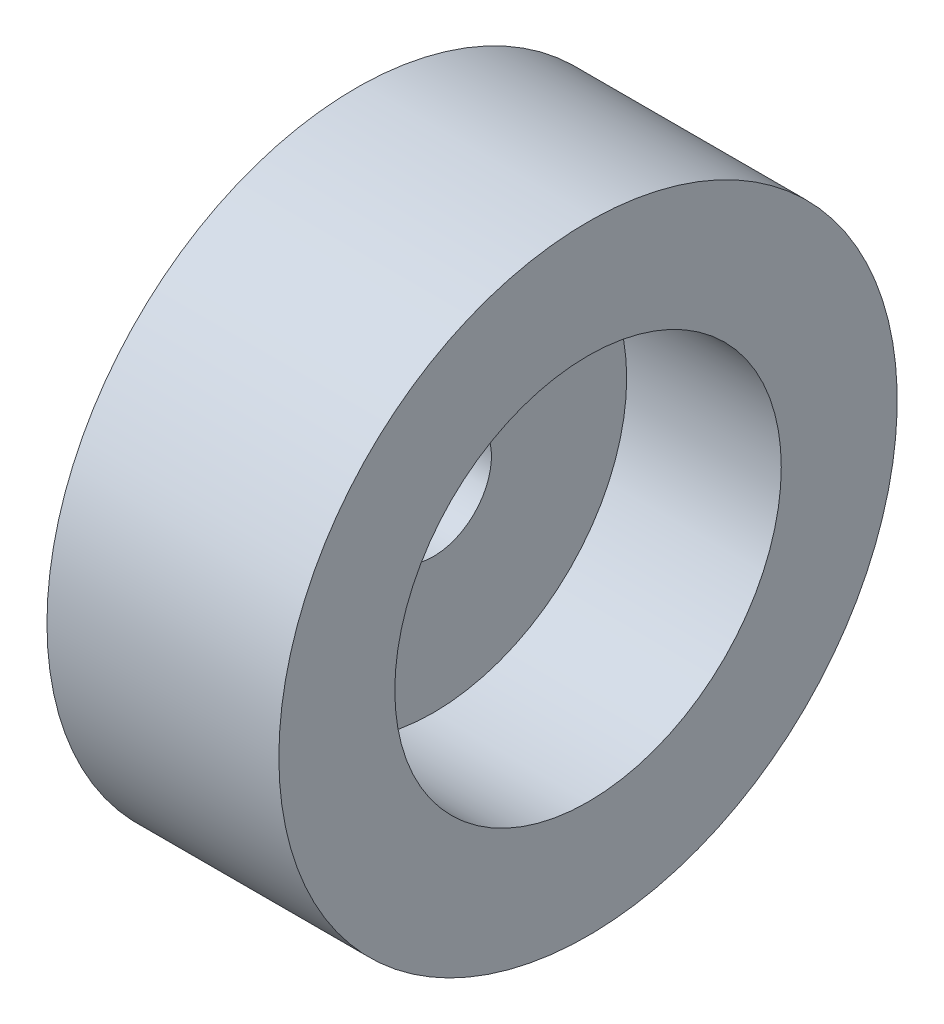
ISO-10303-21;
HEADER;
FILE_DESCRIPTION(('STEP AP214'),'2;1');
FILE_NAME('part.step','',(''),(''),'','','');
FILE_SCHEMA(('AUTOMOTIVE_DESIGN { 1 0 10303 214 1 1 1 1 }'));
ENDSEC;
DATA;
#1=APPLICATION_CONTEXT('core data for automotive mechanical design processes');
#2=APPLICATION_PROTOCOL_DEFINITION('international standard','automotive_design',2000,#1);
#3=PRODUCT_CONTEXT('',#1,'mechanical');
#4=PRODUCT('Part','Part','',(#3));
#5=PRODUCT_RELATED_PRODUCT_CATEGORY('part','',(#4));
#6=PRODUCT_DEFINITION_FORMATION('','',#4);
#7=PRODUCT_DEFINITION_CONTEXT('part definition',#1,'design');
#8=PRODUCT_DEFINITION('design','',#6,#7);
#9=PRODUCT_DEFINITION_SHAPE('','',#8);
#10=(LENGTH_UNIT() NAMED_UNIT(*) SI_UNIT(.MILLI.,.METRE.));
#11=(NAMED_UNIT(*) PLANE_ANGLE_UNIT() SI_UNIT($,.RADIAN.));
#12=(NAMED_UNIT(*) SI_UNIT($,.STERADIAN.) SOLID_ANGLE_UNIT());
#13=UNCERTAINTY_MEASURE_WITH_UNIT(LENGTH_MEASURE(1.E-05),#10,'distance_accuracy_value','');
#14=(GEOMETRIC_REPRESENTATION_CONTEXT(3) GLOBAL_UNCERTAINTY_ASSIGNED_CONTEXT((#13)) GLOBAL_UNIT_ASSIGNED_CONTEXT((#10,
#11,#12)) REPRESENTATION_CONTEXT('',''));
#15=CARTESIAN_POINT('',(0.,0.,0.));
#16=DIRECTION('',(0.,0.,1.));
#17=DIRECTION('',(1.,0.,0.));
#18=AXIS2_PLACEMENT_3D('',#15,#16,#17);
#19=CARTESIAN_POINT('',(0.,2.5,0.));
#20=DIRECTION('',(1.,0.,0.));
#21=DIRECTION('',(0.,0.,-1.));
#22=AXIS2_PLACEMENT_3D('',#19,#20,#21);
#23=PLANE('',#22);
#24=CARTESIAN_POINT('',(0.,0.,0.));
#25=DIRECTION('',(-1.,0.,0.));
#26=DIRECTION('',(0.,0.,1.));
#27=AXIS2_PLACEMENT_3D('',#24,#25,#26);
#28=CIRCLE('',#27,0.75);
#29=CARTESIAN_POINT('',(0.,0.,0.75));
#30=VERTEX_POINT('',#29);
#31=EDGE_CURVE('E10',#30,#30,#28,.T.);
#32=ORIENTED_EDGE('',*,*,#31,.F.);
#33=EDGE_LOOP('',(#32));
#34=FACE_BOUND('',#33,.T.);
#35=CARTESIAN_POINT('',(0.,0.,0.));
#36=DIRECTION('',(-1.,0.,0.));
#37=DIRECTION('',(0.,0.,1.));
#38=AXIS2_PLACEMENT_3D('',#35,#36,#37);
#39=CIRCLE('',#38,2.5);
#40=CARTESIAN_POINT('',(0.,0.,2.5));
#41=VERTEX_POINT('',#40);
#42=EDGE_CURVE('E72',#41,#41,#39,.T.);
#43=ORIENTED_EDGE('',*,*,#42,.T.);
#44=EDGE_LOOP('',(#43));
#45=FACE_BOUND('',#44,.T.);
#46=ADVANCED_FACE('F37',(#34,#45),#23,.F.);
#47=CARTESIAN_POINT('',(0.,0.,0.));
#48=DIRECTION('',(-1.,0.,0.));
#49=DIRECTION('',(0.,0.,1.));
#50=AXIS2_PLACEMENT_3D('',#47,#48,#49);
#51=CYLINDRICAL_SURFACE('',#50,0.75);
#52=CARTESIAN_POINT('',(2.,0.,0.));
#53=DIRECTION('',(-1.,0.,0.));
#54=DIRECTION('',(0.,0.,1.));
#55=AXIS2_PLACEMENT_3D('',#52,#53,#54);
#56=CIRCLE('',#55,0.75);
#57=CARTESIAN_POINT('',(2.,0.,0.75));
#58=VERTEX_POINT('',#57);
#59=EDGE_CURVE('E44',#58,#58,#56,.T.);
#60=ORIENTED_EDGE('',*,*,#59,.F.);
#61=EDGE_LOOP('',(#60));
#62=FACE_BOUND('',#61,.T.);
#63=ORIENTED_EDGE('',*,*,#31,.T.);
#64=EDGE_LOOP('',(#63));
#65=FACE_BOUND('',#64,.T.);
#66=ADVANCED_FACE('F110',(#62,#65),#51,.F.);
#67=CARTESIAN_POINT('',(2.,0.75,0.));
#68=DIRECTION('',(-1.,0.,0.));
#69=DIRECTION('',(0.,0.,1.));
#70=AXIS2_PLACEMENT_3D('',#67,#68,#69);
#71=PLANE('',#70);
#72=CARTESIAN_POINT('',(2.,0.,0.));
#73=DIRECTION('',(-1.,0.,0.));
#74=DIRECTION('',(0.,0.,1.));
#75=AXIS2_PLACEMENT_3D('',#72,#73,#74);
#76=CIRCLE('',#75,2.5);
#77=CARTESIAN_POINT('',(2.,0.,2.5));
#78=VERTEX_POINT('',#77);
#79=EDGE_CURVE('E49',#78,#78,#76,.T.);
#80=ORIENTED_EDGE('',*,*,#79,.F.);
#81=EDGE_LOOP('',(#80));
#82=FACE_BOUND('',#81,.T.);
#83=ORIENTED_EDGE('',*,*,#59,.T.);
#84=EDGE_LOOP('',(#83));
#85=FACE_BOUND('',#84,.T.);
#86=ADVANCED_FACE('F105',(#82,#85),#71,.F.);
#87=CARTESIAN_POINT('',(0.,0.,0.));
#88=DIRECTION('',(-1.,0.,0.));
#89=DIRECTION('',(0.,0.,1.));
#90=AXIS2_PLACEMENT_3D('',#87,#88,#89);
#91=CYLINDRICAL_SURFACE('',#90,2.5);
#92=CARTESIAN_POINT('',(4.,0.,0.));
#93=DIRECTION('',(-1.,0.,0.));
#94=DIRECTION('',(0.,0.,1.));
#95=AXIS2_PLACEMENT_3D('',#92,#93,#94);
#96=CIRCLE('',#95,2.5);
#97=CARTESIAN_POINT('',(4.,0.,2.5));
#98=VERTEX_POINT('',#97);
#99=EDGE_CURVE('E54',#98,#98,#96,.T.);
#100=ORIENTED_EDGE('',*,*,#99,.F.);
#101=EDGE_LOOP('',(#100));
#102=FACE_BOUND('',#101,.T.);
#103=ORIENTED_EDGE('',*,*,#79,.T.);
#104=EDGE_LOOP('',(#103));
#105=FACE_BOUND('',#104,.T.);
#106=ADVANCED_FACE('F99',(#102,#105),#91,.F.);
#107=CARTESIAN_POINT('',(4.,2.5,0.));
#108=DIRECTION('',(-1.,0.,0.));
#109=DIRECTION('',(0.,0.,1.));
#110=AXIS2_PLACEMENT_3D('',#107,#108,#109);
#111=PLANE('',#110);
#112=CARTESIAN_POINT('',(4.,0.,0.));
#113=DIRECTION('',(-1.,0.,0.));
#114=DIRECTION('',(0.,0.,1.));
#115=AXIS2_PLACEMENT_3D('',#112,#113,#114);
#116=CIRCLE('',#115,4.);
#117=CARTESIAN_POINT('',(4.,0.,4.));
#118=VERTEX_POINT('',#117);
#119=EDGE_CURVE('E60',#118,#118,#116,.T.);
#120=ORIENTED_EDGE('',*,*,#119,.F.);
#121=EDGE_LOOP('',(#120));
#122=FACE_BOUND('',#121,.T.);
#123=ORIENTED_EDGE('',*,*,#99,.T.);
#124=EDGE_LOOP('',(#123));
#125=FACE_BOUND('',#124,.T.);
#126=ADVANCED_FACE('F93',(#122,#125),#111,.F.);
#127=CARTESIAN_POINT('',(0.,0.,0.));
#128=DIRECTION('',(-1.,0.,0.));
#129=DIRECTION('',(0.,0.,1.));
#130=AXIS2_PLACEMENT_3D('',#127,#128,#129);
#131=CYLINDRICAL_SURFACE('',#130,4.);
#132=CARTESIAN_POINT('',(1.,0.,0.));
#133=DIRECTION('',(-1.,0.,0.));
#134=DIRECTION('',(0.,0.,1.));
#135=AXIS2_PLACEMENT_3D('',#132,#133,#134);
#136=CIRCLE('',#135,4.);
#137=CARTESIAN_POINT('',(1.,0.,4.));
#138=VERTEX_POINT('',#137);
#139=EDGE_CURVE('E64',#138,#138,#136,.T.);
#140=ORIENTED_EDGE('',*,*,#139,.F.);
#141=EDGE_LOOP('',(#140));
#142=FACE_BOUND('',#141,.T.);
#143=ORIENTED_EDGE('',*,*,#119,.T.);
#144=EDGE_LOOP('',(#143));
#145=FACE_BOUND('',#144,.T.);
#146=ADVANCED_FACE('F87',(#142,#145),#131,.T.);
#147=CARTESIAN_POINT('',(1.,4.,0.));
#148=DIRECTION('',(1.,0.,0.));
#149=DIRECTION('',(0.,0.,-1.));
#150=AXIS2_PLACEMENT_3D('',#147,#148,#149);
#151=PLANE('',#150);
#152=CARTESIAN_POINT('',(1.,0.,0.));
#153=DIRECTION('',(-1.,0.,0.));
#154=DIRECTION('',(0.,0.,1.));
#155=AXIS2_PLACEMENT_3D('',#152,#153,#154);
#156=CIRCLE('',#155,2.5);
#157=CARTESIAN_POINT('',(1.,0.,2.5));
#158=VERTEX_POINT('',#157);
#159=EDGE_CURVE('E68',#158,#158,#156,.T.);
#160=ORIENTED_EDGE('',*,*,#159,.F.);
#161=EDGE_LOOP('',(#160));
#162=FACE_BOUND('',#161,.T.);
#163=ORIENTED_EDGE('',*,*,#139,.T.);
#164=EDGE_LOOP('',(#163));
#165=FACE_BOUND('',#164,.T.);
#166=ADVANCED_FACE('F81',(#162,#165),#151,.F.);
#167=CARTESIAN_POINT('',(0.,0.,0.));
#168=DIRECTION('',(-1.,0.,0.));
#169=DIRECTION('',(0.,0.,1.));
#170=AXIS2_PLACEMENT_3D('',#167,#168,#169);
#171=CYLINDRICAL_SURFACE('',#170,2.5);
#172=ORIENTED_EDGE('',*,*,#42,.F.);
#173=EDGE_LOOP('',(#172));
#174=FACE_BOUND('',#173,.T.);
#175=ORIENTED_EDGE('',*,*,#159,.T.);
#176=EDGE_LOOP('',(#175));
#177=FACE_BOUND('',#176,.T.);
#178=ADVANCED_FACE('F78',(#174,#177),#171,.T.);
#179=CLOSED_SHELL('',(#46,#66,#86,#106,#126,#146,#166,#178));
#180=MANIFOLD_SOLID_BREP('B2',#179);
#181=ADVANCED_BREP_SHAPE_REPRESENTATION('',(#18,#180),#14);
#182=SHAPE_DEFINITION_REPRESENTATION(#9,#181);
ENDSEC;
END-ISO-10303-21;
